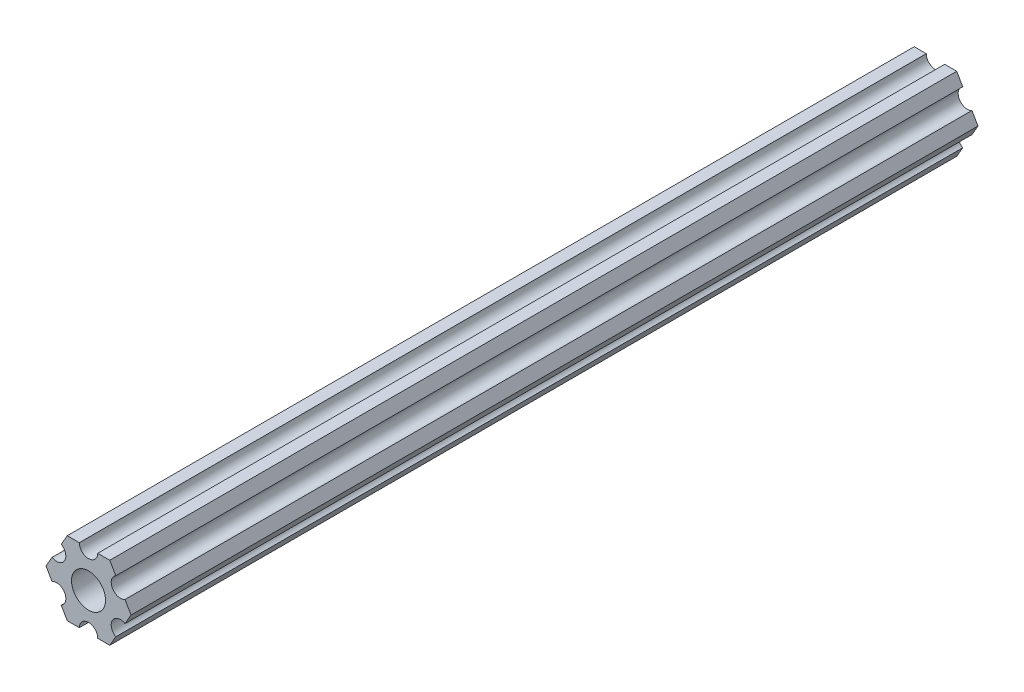
ISO-10303-21;
HEADER;
FILE_DESCRIPTION(('STEP AP214'),'2;1');
FILE_NAME('part.step','',(''),(''),'','','');
FILE_SCHEMA(('AUTOMOTIVE_DESIGN { 1 0 10303 214 1 1 1 1 }'));
ENDSEC;
DATA;
#1=APPLICATION_CONTEXT('core data for automotive mechanical design processes');
#2=APPLICATION_PROTOCOL_DEFINITION('international standard','automotive_design',2000,#1);
#3=PRODUCT_CONTEXT('',#1,'mechanical');
#4=PRODUCT('Part','Part','',(#3));
#5=PRODUCT_RELATED_PRODUCT_CATEGORY('part','',(#4));
#6=PRODUCT_DEFINITION_FORMATION('','',#4);
#7=PRODUCT_DEFINITION_CONTEXT('part definition',#1,'design');
#8=PRODUCT_DEFINITION('design','',#6,#7);
#9=PRODUCT_DEFINITION_SHAPE('','',#8);
#10=(LENGTH_UNIT() NAMED_UNIT(*) SI_UNIT(.MILLI.,.METRE.));
#11=(NAMED_UNIT(*) PLANE_ANGLE_UNIT() SI_UNIT($,.RADIAN.));
#12=(NAMED_UNIT(*) SI_UNIT($,.STERADIAN.) SOLID_ANGLE_UNIT());
#13=UNCERTAINTY_MEASURE_WITH_UNIT(LENGTH_MEASURE(1.E-05),#10,'distance_accuracy_value','');
#14=(GEOMETRIC_REPRESENTATION_CONTEXT(3) GLOBAL_UNCERTAINTY_ASSIGNED_CONTEXT((#13)) GLOBAL_UNIT_ASSIGNED_CONTEXT((#10,
#11,#12)) REPRESENTATION_CONTEXT('',''));
#15=CARTESIAN_POINT('',(0.,0.,0.));
#16=DIRECTION('',(0.,0.,1.));
#17=DIRECTION('',(1.,0.,0.));
#18=AXIS2_PLACEMENT_3D('',#15,#16,#17);
#19=CARTESIAN_POINT('',(6.29301142309098,-1.80018429024546,304.8));
#20=DIRECTION('',(-0.866025434075723,0.499999947533953,0.));
#21=DIRECTION('',(-0.499999947533953,-0.866025434075723,0.));
#22=AXIS2_PLACEMENT_3D('',#19,#20,#21);
#23=PLANE('',#22);
#24=DIRECTION('',(0.499999947533953,0.866025434075723,0.));
#25=VECTOR('',#24,1.);
#26=CARTESIAN_POINT('',(6.29301142309098,-1.80018429024546,146.05));
#27=LINE('',#26,#25);
#28=CARTESIAN_POINT('',(6.29301142309098,-1.80018429024546,146.05));
#29=VERTEX_POINT('',#28);
#30=CARTESIAN_POINT('',(7.33234841870826,4.44212519169686E-07,146.05));
#31=VERTEX_POINT('',#30);
#32=EDGE_CURVE('E173',#29,#31,#27,.T.);
#33=ORIENTED_EDGE('',*,*,#32,.F.);
#34=DIRECTION('',(0.,0.,-1.));
#35=VECTOR('',#34,1.);
#36=CARTESIAN_POINT('',(6.29301142309098,-1.80018429024546,304.8));
#37=LINE('',#36,#35);
#38=CARTESIAN_POINT('',(6.29301142309098,-1.80018429024546,0.));
#39=VERTEX_POINT('',#38);
#40=EDGE_CURVE('E61',#29,#39,#37,.T.);
#41=ORIENTED_EDGE('',*,*,#40,.T.);
#42=DIRECTION('',(0.499999947533953,0.866025434075723,0.));
#43=VECTOR('',#42,1.);
#44=CARTESIAN_POINT('',(6.29301142309098,-1.80018429024546,0.));
#45=LINE('',#44,#43);
#46=CARTESIAN_POINT('',(7.33234841870826,4.44212518961143E-07,0.));
#47=VERTEX_POINT('',#46);
#48=EDGE_CURVE('E44',#39,#47,#45,.T.);
#49=ORIENTED_EDGE('',*,*,#48,.T.);
#50=DIRECTION('',(0.,0.,1.));
#51=VECTOR('',#50,1.);
#52=CARTESIAN_POINT('',(7.33234841870826,4.44212519169686E-07,304.8));
#53=LINE('',#52,#51);
#54=EDGE_CURVE('E180',#47,#31,#53,.T.);
#55=ORIENTED_EDGE('',*,*,#54,.T.);
#56=EDGE_LOOP('',(#33,#41,#49,#55));
#57=FACE_BOUND('',#56,.T.);
#58=ADVANCED_FACE('F36',(#57),#23,.F.);
#59=CARTESIAN_POINT('',(7.33234841870826,4.44212519169686E-07,304.8));
#60=DIRECTION('',(-0.866025373493145,-0.500000052466056,0.));
#61=DIRECTION('',(0.500000052466056,-0.866025373493145,0.));
#62=AXIS2_PLACEMENT_3D('',#59,#60,#61);
#63=PLANE('',#62);
#64=DIRECTION('',(-0.500000052466056,0.866025373493145,0.));
#65=VECTOR('',#64,1.);
#66=CARTESIAN_POINT('',(7.33234841870826,4.44212519169686E-07,146.05));
#67=LINE('',#66,#65);
#68=CARTESIAN_POINT('',(6.29301120497139,1.80018505273895,146.05));
#69=VERTEX_POINT('',#68);
#70=EDGE_CURVE('E181',#31,#69,#67,.T.);
#71=ORIENTED_EDGE('',*,*,#70,.F.);
#72=ORIENTED_EDGE('',*,*,#54,.F.);
#73=DIRECTION('',(-0.500000052466056,0.866025373493145,0.));
#74=VECTOR('',#73,1.);
#75=CARTESIAN_POINT('',(7.33234841870826,4.44212519198905E-07,0.));
#76=LINE('',#75,#74);
#77=CARTESIAN_POINT('',(6.29301120497139,1.80018505273895,0.));
#78=VERTEX_POINT('',#77);
#79=EDGE_CURVE('E187',#47,#78,#76,.T.);
#80=ORIENTED_EDGE('',*,*,#79,.T.);
#81=DIRECTION('',(0.,0.,-1.));
#82=VECTOR('',#81,1.);
#83=CARTESIAN_POINT('',(6.29301120497139,1.80018505273895,304.8));
#84=LINE('',#83,#82);
#85=EDGE_CURVE('E245',#78,#69,#84,.F.);
#86=ORIENTED_EDGE('',*,*,#85,.T.);
#87=EDGE_LOOP('',(#71,#72,#80,#86));
#88=FACE_BOUND('',#87,.T.);
#89=ADVANCED_FACE('F402',(#88),#63,.F.);
#90=CARTESIAN_POINT('',(5.49926112168156,3.17500033315933,304.8));
#91=DIRECTION('',(0.,0.,-1.));
#92=DIRECTION('',(-1.,0.,0.));
#93=AXIS2_PLACEMENT_3D('',#90,#91,#92);
#94=CYLINDRICAL_SURFACE('',#93,1.5875);
#95=CARTESIAN_POINT('',(5.49926112168156,3.17500033315933,146.05));
#96=DIRECTION('',(0.,0.,1.));
#97=DIRECTION('',(1.,0.,0.));
#98=AXIS2_PLACEMENT_3D('',#95,#96,#97);
#99=CIRCLE('',#98,1.5875);
#100=CARTESIAN_POINT('',(4.70551103839172,4.54981561357972,146.05));
#101=VERTEX_POINT('',#100);
#102=EDGE_CURVE('E319',#69,#101,#99,.F.);
#103=ORIENTED_EDGE('',*,*,#102,.F.);
#104=ORIENTED_EDGE('',*,*,#85,.F.);
#105=CARTESIAN_POINT('',(5.49926112168156,3.17500033315933,0.));
#106=DIRECTION('',(0.,0.,-1.));
#107=DIRECTION('',(-1.,0.,0.));
#108=AXIS2_PLACEMENT_3D('',#105,#106,#107);
#109=CIRCLE('',#108,1.5875);
#110=CARTESIAN_POINT('',(4.70551103839172,4.54981561357972,0.));
#111=VERTEX_POINT('',#110);
#112=EDGE_CURVE('E105',#78,#111,#109,.T.);
#113=ORIENTED_EDGE('',*,*,#112,.T.);
#114=DIRECTION('',(0.,0.,1.));
#115=VECTOR('',#114,1.);
#116=CARTESIAN_POINT('',(4.70551103839172,4.54981561357972,304.8));
#117=LINE('',#116,#115);
#118=EDGE_CURVE('E241',#111,#101,#117,.T.);
#119=ORIENTED_EDGE('',*,*,#118,.T.);
#120=EDGE_LOOP('',(#103,#104,#113,#119));
#121=FACE_BOUND('',#120,.T.);
#122=ADVANCED_FACE('F400',(#121),#94,.F.);
#123=CARTESIAN_POINT('',(4.70551103839172,4.54981561357972,304.8));
#124=DIRECTION('',(-0.866025373493151,-0.500000052466046,0.));
#125=DIRECTION('',(0.500000052466046,-0.866025373493151,0.));
#126=AXIS2_PLACEMENT_3D('',#123,#124,#125);
#127=PLANE('',#126);
#128=DIRECTION('',(-0.500000052466046,0.866025373493151,0.));
#129=VECTOR('',#128,1.);
#130=CARTESIAN_POINT('',(4.70551103839172,4.54981561357972,146.05));
#131=LINE('',#130,#129);
#132=CARTESIAN_POINT('',(3.66617382465481,6.35000022210627,146.05));
#133=VERTEX_POINT('',#132);
#134=EDGE_CURVE('E321',#101,#133,#131,.T.);
#135=ORIENTED_EDGE('',*,*,#134,.F.);
#136=ORIENTED_EDGE('',*,*,#118,.F.);
#137=DIRECTION('',(-0.500000052466046,0.866025373493151,0.));
#138=VECTOR('',#137,1.);
#139=CARTESIAN_POINT('',(4.70551103839172,4.54981561357972,0.));
#140=LINE('',#139,#138);
#141=CARTESIAN_POINT('',(3.66617382465481,6.35000022210627,0.));
#142=VERTEX_POINT('',#141);
#143=EDGE_CURVE('E272',#111,#142,#140,.T.);
#144=ORIENTED_EDGE('',*,*,#143,.T.);
#145=DIRECTION('',(0.,0.,1.));
#146=VECTOR('',#145,1.);
#147=CARTESIAN_POINT('',(3.66617382465481,6.35000022210627,304.8));
#148=LINE('',#147,#146);
#149=EDGE_CURVE('E112',#142,#133,#148,.T.);
#150=ORIENTED_EDGE('',*,*,#149,.T.);
#151=EDGE_LOOP('',(#135,#136,#144,#150));
#152=FACE_BOUND('',#151,.T.);
#153=ADVANCED_FACE('F398',(#152),#127,.F.);
#154=CARTESIAN_POINT('',(3.66617382465481,6.35000022210627,304.8));
#155=DIRECTION('',(6.05825850611185E-08,-0.999999999999998,0.));
#156=DIRECTION('',(0.999999999999998,6.05825850611185E-08,0.));
#157=AXIS2_PLACEMENT_3D('',#154,#155,#156);
#158=PLANE('',#157);
#159=DIRECTION('',(-0.999999999999998,-6.05825850611185E-08,0.));
#160=VECTOR('',#159,1.);
#161=CARTESIAN_POINT('',(3.66617382465481,6.35000022210627,146.05));
#162=LINE('',#161,#160);
#163=CARTESIAN_POINT('',(1.58749961530074,6.35,146.05));
#164=VERTEX_POINT('',#163);
#165=EDGE_CURVE('E323',#133,#164,#162,.T.);
#166=ORIENTED_EDGE('',*,*,#165,.F.);
#167=ORIENTED_EDGE('',*,*,#149,.F.);
#168=DIRECTION('',(1.,0.,0.));
#169=VECTOR('',#168,1.);
#170=CARTESIAN_POINT('',(5.49926112168156,6.35000022210627,0.));
#171=LINE('',#170,#169);
#172=CARTESIAN_POINT('',(1.58749961530073,6.35000015914054,0.));
#173=VERTEX_POINT('',#172);
#174=EDGE_CURVE('E271',#142,#173,#171,.F.);
#175=ORIENTED_EDGE('',*,*,#174,.T.);
#176=DIRECTION('',(0.,0.,-1.));
#177=VECTOR('',#176,1.);
#178=CARTESIAN_POINT('',(1.58749961530074,6.35000009617482,304.8));
#179=LINE('',#178,#177);
#180=EDGE_CURVE('E237',#173,#164,#179,.F.);
#181=ORIENTED_EDGE('',*,*,#180,.T.);
#182=EDGE_LOOP('',(#166,#167,#175,#181));
#183=FACE_BOUND('',#182,.T.);
#184=ADVANCED_FACE('F396',(#183),#158,.F.);
#185=CARTESIAN_POINT('',(-3.84699260060323E-07,6.35,304.8));
#186=DIRECTION('',(0.,0.,-1.));
#187=DIRECTION('',(-1.,0.,0.));
#188=AXIS2_PLACEMENT_3D('',#185,#186,#187);
#189=CYLINDRICAL_SURFACE('',#188,1.5875);
#190=CARTESIAN_POINT('',(-3.84699260060323E-07,6.35,146.05));
#191=DIRECTION('',(0.,0.,1.));
#192=DIRECTION('',(1.,0.,0.));
#193=AXIS2_PLACEMENT_3D('',#190,#191,#192);
#194=CIRCLE('',#193,1.5875);
#195=CARTESIAN_POINT('',(-1.58750038469926,6.34999990382518,146.05));
#196=VERTEX_POINT('',#195);
#197=EDGE_CURVE('E325',#164,#196,#194,.F.);
#198=ORIENTED_EDGE('',*,*,#197,.F.);
#199=ORIENTED_EDGE('',*,*,#180,.F.);
#200=CARTESIAN_POINT('',(-3.84699260060323E-07,6.35,0.));
#201=DIRECTION('',(0.,0.,-1.));
#202=DIRECTION('',(-1.,0.,0.));
#203=AXIS2_PLACEMENT_3D('',#200,#201,#202);
#204=CIRCLE('',#203,1.5875);
#205=CARTESIAN_POINT('',(-1.58750038469926,6.34999990382518,0.));
#206=VERTEX_POINT('',#205);
#207=EDGE_CURVE('E268',#173,#206,#204,.T.);
#208=ORIENTED_EDGE('',*,*,#207,.T.);
#209=DIRECTION('',(0.,0.,1.));
#210=VECTOR('',#209,1.);
#211=CARTESIAN_POINT('',(-1.58750038469926,6.34999990382518,304.8));
#212=LINE('',#211,#210);
#213=EDGE_CURVE('E232',#206,#196,#212,.T.);
#214=ORIENTED_EDGE('',*,*,#213,.T.);
#215=EDGE_LOOP('',(#198,#199,#208,#214));
#216=FACE_BOUND('',#215,.T.);
#217=ADVANCED_FACE('F395',(#216),#189,.F.);
#218=CARTESIAN_POINT('',(-1.58750038469926,6.34999990382518,304.8));
#219=DIRECTION('',(6.05825963273174E-08,-0.999999999999998,0.));
#220=DIRECTION('',(0.999999999999998,6.05825963273174E-08,0.));
#221=AXIS2_PLACEMENT_3D('',#218,#219,#220);
#222=PLANE('',#221);
#223=DIRECTION('',(-0.999999999999998,-6.05825963273174E-08,0.));
#224=VECTOR('',#223,1.);
#225=CARTESIAN_POINT('',(-1.58750038469926,6.34999990382518,146.05));
#226=LINE('',#225,#224);
#227=CARTESIAN_POINT('',(-3.66617459405349,6.3499997778937,146.05));
#228=VERTEX_POINT('',#227);
#229=EDGE_CURVE('E327',#196,#228,#226,.T.);
#230=ORIENTED_EDGE('',*,*,#229,.F.);
#231=ORIENTED_EDGE('',*,*,#213,.F.);
#232=DIRECTION('',(1.,0.,0.));
#233=VECTOR('',#232,1.);
#234=CARTESIAN_POINT('',(5.49926112168156,6.34999990382518,0.));
#235=LINE('',#234,#233);
#236=CARTESIAN_POINT('',(-3.66617454558244,6.34999986184803,0.));
#237=VERTEX_POINT('',#236);
#238=EDGE_CURVE('E270',#206,#237,#235,.F.);
#239=ORIENTED_EDGE('',*,*,#238,.T.);
#240=DIRECTION('',(0.,0.,1.));
#241=VECTOR('',#240,1.);
#242=CARTESIAN_POINT('',(-3.66617459405349,6.3499997778937,304.8));
#243=LINE('',#242,#241);
#244=EDGE_CURVE('E229',#237,#228,#243,.T.);
#245=ORIENTED_EDGE('',*,*,#244,.T.);
#246=EDGE_LOOP('',(#230,#231,#239,#245));
#247=FACE_BOUND('',#246,.T.);
#248=ADVANCED_FACE('F392',(#247),#222,.F.);
#249=CARTESIAN_POINT('',(-3.66617459405349,6.3499997778937,304.8));
#250=DIRECTION('',(0.866025434075729,-0.499999947533942,0.));
#251=DIRECTION('',(0.499999947533942,0.866025434075729,0.));
#252=AXIS2_PLACEMENT_3D('',#249,#250,#251);
#253=PLANE('',#252);
#254=DIRECTION('',(-0.499999947533942,-0.866025434075729,0.));
#255=VECTOR('',#254,1.);
#256=CARTESIAN_POINT('',(-3.66617459405349,6.3499997778937,146.05));
#257=LINE('',#256,#255);
#258=CARTESIAN_POINT('',(-4.70551158967065,4.54981504343587,146.05));
#259=VERTEX_POINT('',#258);
#260=EDGE_CURVE('E329',#228,#259,#257,.T.);
#261=ORIENTED_EDGE('',*,*,#260,.F.);
#262=ORIENTED_EDGE('',*,*,#244,.F.);
#263=DIRECTION('',(-0.499999947533943,-0.866025434075729,0.));
#264=VECTOR('',#263,1.);
#265=CARTESIAN_POINT('',(-3.66617459405349,6.3499997778937,0.));
#266=LINE('',#265,#264);
#267=CARTESIAN_POINT('',(-4.70551158967065,4.54981504343587,0.));
#268=VERTEX_POINT('',#267);
#269=EDGE_CURVE('E267',#237,#268,#266,.T.);
#270=ORIENTED_EDGE('',*,*,#269,.T.);
#271=DIRECTION('',(0.,0.,-1.));
#272=VECTOR('',#271,1.);
#273=CARTESIAN_POINT('',(-4.70551158967065,4.54981504343587,304.8));
#274=LINE('',#273,#272);
#275=EDGE_CURVE('E226',#268,#259,#274,.F.);
#276=ORIENTED_EDGE('',*,*,#275,.T.);
#277=EDGE_LOOP('',(#261,#262,#270,#276));
#278=FACE_BOUND('',#277,.T.);
#279=ADVANCED_FACE('F387',(#278),#253,.F.);
#280=CARTESIAN_POINT('',(-5.49926150638082,3.17499966684067,304.8));
#281=DIRECTION('',(0.,0.,-1.));
#282=DIRECTION('',(-1.,0.,0.));
#283=AXIS2_PLACEMENT_3D('',#280,#281,#282);
#284=CYLINDRICAL_SURFACE('',#283,1.5875);
#285=CARTESIAN_POINT('',(-5.49926150638082,3.17499966684067,146.05));
#286=DIRECTION('',(0.,0.,1.));
#287=DIRECTION('',(1.,0.,0.));
#288=AXIS2_PLACEMENT_3D('',#285,#286,#287);
#289=CIRCLE('',#288,1.5875);
#290=CARTESIAN_POINT('',(-6.29301142309098,1.80018429024547,146.05));
#291=VERTEX_POINT('',#290);
#292=EDGE_CURVE('E331',#259,#291,#289,.F.);
#293=ORIENTED_EDGE('',*,*,#292,.F.);
#294=ORIENTED_EDGE('',*,*,#275,.F.);
#295=CARTESIAN_POINT('',(-5.49926150638082,3.17499966684067,0.));
#296=DIRECTION('',(0.,0.,-1.));
#297=DIRECTION('',(-1.,0.,0.));
#298=AXIS2_PLACEMENT_3D('',#295,#296,#297);
#299=CIRCLE('',#298,1.5875);
#300=CARTESIAN_POINT('',(-6.29301142309098,1.80018429024547,0.));
#301=VERTEX_POINT('',#300);
#302=EDGE_CURVE('E263',#268,#301,#299,.T.);
#303=ORIENTED_EDGE('',*,*,#302,.T.);
#304=DIRECTION('',(0.,0.,1.));
#305=VECTOR('',#304,1.);
#306=CARTESIAN_POINT('',(-6.29301142309098,1.80018429024547,304.8));
#307=LINE('',#306,#305);
#308=EDGE_CURVE('E221',#301,#291,#307,.T.);
#309=ORIENTED_EDGE('',*,*,#308,.T.);
#310=EDGE_LOOP('',(#293,#294,#303,#309));
#311=FACE_BOUND('',#310,.T.);
#312=ADVANCED_FACE('F384',(#311),#284,.F.);
#313=CARTESIAN_POINT('',(-6.29301142309098,1.80018429024547,304.8));
#314=DIRECTION('',(0.866025434075724,-0.499999947533951,0.));
#315=DIRECTION('',(0.499999947533951,0.866025434075724,0.));
#316=AXIS2_PLACEMENT_3D('',#313,#314,#315);
#317=PLANE('',#316);
#318=DIRECTION('',(-0.499999947533951,-0.866025434075724,0.));
#319=VECTOR('',#318,1.);
#320=CARTESIAN_POINT('',(-6.29301142309098,1.80018429024547,146.05));
#321=LINE('',#320,#319);
#322=CARTESIAN_POINT('',(-7.33234841870826,-4.44212523790841E-07,146.05));
#323=VERTEX_POINT('',#322);
#324=EDGE_CURVE('E333',#291,#323,#321,.T.);
#325=ORIENTED_EDGE('',*,*,#324,.F.);
#326=ORIENTED_EDGE('',*,*,#308,.F.);
#327=DIRECTION('',(-0.499999947533952,-0.866025434075724,0.));
#328=VECTOR('',#327,1.);
#329=CARTESIAN_POINT('',(-6.29301142309098,1.80018429024547,0.));
#330=LINE('',#329,#328);
#331=CARTESIAN_POINT('',(-7.33234841870826,-4.44212524036367E-07,0.));
#332=VERTEX_POINT('',#331);
#333=EDGE_CURVE('E266',#301,#332,#330,.T.);
#334=ORIENTED_EDGE('',*,*,#333,.T.);
#335=DIRECTION('',(0.,0.,1.));
#336=VECTOR('',#335,1.);
#337=CARTESIAN_POINT('',(-7.33234841870826,-4.44212523790841E-07,304.8));
#338=LINE('',#337,#336);
#339=EDGE_CURVE('E218',#332,#323,#338,.T.);
#340=ORIENTED_EDGE('',*,*,#339,.T.);
#341=EDGE_LOOP('',(#325,#326,#334,#340));
#342=FACE_BOUND('',#341,.T.);
#343=ADVANCED_FACE('F379',(#342),#317,.F.);
#344=CARTESIAN_POINT('',(-7.33234841870826,-4.44212523790841E-07,304.8));
#345=DIRECTION('',(0.866025373493151,0.500000052466045,0.));
#346=DIRECTION('',(-0.500000052466045,0.866025373493151,0.));
#347=AXIS2_PLACEMENT_3D('',#344,#345,#346);
#348=PLANE('',#347);
#349=DIRECTION('',(0.500000052466045,-0.866025373493151,0.));
#350=VECTOR('',#349,1.);
#351=CARTESIAN_POINT('',(-7.33234841870826,-4.44212523790841E-07,146.05));
#352=LINE('',#351,#350);
#353=CARTESIAN_POINT('',(-6.29301120497141,-1.80018505273896,146.05));
#354=VERTEX_POINT('',#353);
#355=EDGE_CURVE('E335',#323,#354,#352,.T.);
#356=ORIENTED_EDGE('',*,*,#355,.F.);
#357=ORIENTED_EDGE('',*,*,#339,.F.);
#358=DIRECTION('',(0.500000052466045,-0.866025373493151,0.));
#359=VECTOR('',#358,1.);
#360=CARTESIAN_POINT('',(-7.33234841870826,-4.44212523969395E-07,0.));
#361=LINE('',#360,#359);
#362=CARTESIAN_POINT('',(-6.29301120497141,-1.80018505273896,0.));
#363=VERTEX_POINT('',#362);
#364=EDGE_CURVE('E262',#332,#363,#361,.T.);
#365=ORIENTED_EDGE('',*,*,#364,.T.);
#366=DIRECTION('',(0.,0.,-1.));
#367=VECTOR('',#366,1.);
#368=CARTESIAN_POINT('',(-6.29301120497141,-1.80018505273896,304.8));
#369=LINE('',#368,#367);
#370=EDGE_CURVE('E215',#363,#354,#369,.F.);
#371=ORIENTED_EDGE('',*,*,#370,.T.);
#372=EDGE_LOOP('',(#356,#357,#365,#371));
#373=FACE_BOUND('',#372,.T.);
#374=ADVANCED_FACE('F376',(#373),#348,.F.);
#375=CARTESIAN_POINT('',(-5.49926112168156,-3.17500033315934,304.8));
#376=DIRECTION('',(0.,0.,-1.));
#377=DIRECTION('',(-1.,0.,0.));
#378=AXIS2_PLACEMENT_3D('',#375,#376,#377);
#379=CYLINDRICAL_SURFACE('',#378,1.5875);
#380=CARTESIAN_POINT('',(-5.49926112168156,-3.17500033315934,146.05));
#381=DIRECTION('',(0.,0.,1.));
#382=DIRECTION('',(1.,0.,0.));
#383=AXIS2_PLACEMENT_3D('',#380,#381,#382);
#384=CIRCLE('',#383,1.5875);
#385=CARTESIAN_POINT('',(-4.70551103839172,-4.54981561357972,146.05));
#386=VERTEX_POINT('',#385);
#387=EDGE_CURVE('E337',#354,#386,#384,.F.);
#388=ORIENTED_EDGE('',*,*,#387,.F.);
#389=ORIENTED_EDGE('',*,*,#370,.F.);
#390=CARTESIAN_POINT('',(-5.49926112168156,-3.17500033315934,0.));
#391=DIRECTION('',(0.,0.,-1.));
#392=DIRECTION('',(-1.,0.,0.));
#393=AXIS2_PLACEMENT_3D('',#390,#391,#392);
#394=CIRCLE('',#393,1.5875);
#395=CARTESIAN_POINT('',(-4.70551103839172,-4.54981561357972,0.));
#396=VERTEX_POINT('',#395);
#397=EDGE_CURVE('E258',#363,#396,#394,.T.);
#398=ORIENTED_EDGE('',*,*,#397,.T.);
#399=DIRECTION('',(0.,0.,1.));
#400=VECTOR('',#399,1.);
#401=CARTESIAN_POINT('',(-4.70551103839172,-4.54981561357972,304.8));
#402=LINE('',#401,#400);
#403=EDGE_CURVE('E210',#396,#386,#402,.T.);
#404=ORIENTED_EDGE('',*,*,#403,.T.);
#405=EDGE_LOOP('',(#388,#389,#398,#404));
#406=FACE_BOUND('',#405,.T.);
#407=ADVANCED_FACE('F371',(#406),#379,.F.);
#408=CARTESIAN_POINT('',(-4.70551103839172,-4.54981561357972,304.8));
#409=DIRECTION('',(0.866025373493151,0.500000052466045,0.));
#410=DIRECTION('',(-0.500000052466045,0.866025373493151,0.));
#411=AXIS2_PLACEMENT_3D('',#408,#409,#410);
#412=PLANE('',#411);
#413=DIRECTION('',(0.500000052466045,-0.866025373493151,0.));
#414=VECTOR('',#413,1.);
#415=CARTESIAN_POINT('',(-4.70551103839172,-4.54981561357972,146.05));
#416=LINE('',#415,#414);
#417=CARTESIAN_POINT('',(-3.66617382465481,-6.35000022210628,146.05));
#418=VERTEX_POINT('',#417);
#419=EDGE_CURVE('E339',#386,#418,#416,.T.);
#420=ORIENTED_EDGE('',*,*,#419,.F.);
#421=ORIENTED_EDGE('',*,*,#403,.F.);
#422=DIRECTION('',(0.500000052466045,-0.866025373493151,0.));
#423=VECTOR('',#422,1.);
#424=CARTESIAN_POINT('',(-4.70551103839172,-4.54981561357972,0.));
#425=LINE('',#424,#423);
#426=CARTESIAN_POINT('',(-3.6661738246548,-6.35000022210628,0.));
#427=VERTEX_POINT('',#426);
#428=EDGE_CURVE('E261',#396,#427,#425,.T.);
#429=ORIENTED_EDGE('',*,*,#428,.T.);
#430=DIRECTION('',(0.,0.,1.));
#431=VECTOR('',#430,1.);
#432=CARTESIAN_POINT('',(-3.66617382465481,-6.35000022210628,304.8));
#433=LINE('',#432,#431);
#434=EDGE_CURVE('E207',#427,#418,#433,.T.);
#435=ORIENTED_EDGE('',*,*,#434,.T.);
#436=EDGE_LOOP('',(#420,#421,#429,#435));
#437=FACE_BOUND('',#436,.T.);
#438=ADVANCED_FACE('F368',(#437),#412,.F.);
#439=CARTESIAN_POINT('',(-3.66617382465481,-6.35000022210628,304.8));
#440=DIRECTION('',(-6.05825854783851E-08,0.999999999999998,0.));
#441=DIRECTION('',(-0.999999999999998,-6.05825854783851E-08,0.));
#442=AXIS2_PLACEMENT_3D('',#439,#440,#441);
#443=PLANE('',#442);
#444=DIRECTION('',(0.999999999999998,6.05825854783851E-08,0.));
#445=VECTOR('',#444,1.);
#446=CARTESIAN_POINT('',(-3.66617382465481,-6.35000022210628,146.05));
#447=LINE('',#446,#445);
#448=CARTESIAN_POINT('',(-1.58749961530073,-6.35000011105314,146.05));
#449=VERTEX_POINT('',#448);
#450=EDGE_CURVE('E341',#418,#449,#447,.T.);
#451=ORIENTED_EDGE('',*,*,#450,.F.);
#452=ORIENTED_EDGE('',*,*,#434,.F.);
#453=DIRECTION('',(1.,0.,0.));
#454=VECTOR('',#453,1.);
#455=CARTESIAN_POINT('',(5.49926112168156,-6.35000022210628,0.));
#456=LINE('',#455,#454);
#457=CARTESIAN_POINT('',(-1.58749961530073,-6.35000011105314,0.));
#458=VERTEX_POINT('',#457);
#459=EDGE_CURVE('E257',#427,#458,#456,.T.);
#460=ORIENTED_EDGE('',*,*,#459,.T.);
#461=DIRECTION('',(0.,0.,-1.));
#462=VECTOR('',#461,1.);
#463=CARTESIAN_POINT('',(-1.58749961530074,-6.35,304.8));
#464=LINE('',#463,#462);
#465=EDGE_CURVE('E204',#458,#449,#464,.F.);
#466=ORIENTED_EDGE('',*,*,#465,.T.);
#467=EDGE_LOOP('',(#451,#452,#460,#466));
#468=FACE_BOUND('',#467,.T.);
#469=ADVANCED_FACE('F363',(#468),#443,.F.);
#470=CARTESIAN_POINT('',(3.8469926204343E-07,-6.35,304.8));
#471=DIRECTION('',(0.,0.,-1.));
#472=DIRECTION('',(-1.,0.,0.));
#473=AXIS2_PLACEMENT_3D('',#470,#471,#472);
#474=CYLINDRICAL_SURFACE('',#473,1.5875);
#475=CARTESIAN_POINT('',(3.8469926204343E-07,-6.35,146.05));
#476=DIRECTION('',(0.,0.,1.));
#477=DIRECTION('',(1.,0.,0.));
#478=AXIS2_PLACEMENT_3D('',#475,#476,#477);
#479=CIRCLE('',#478,1.5875);
#480=CARTESIAN_POINT('',(1.58750038469926,-6.34999990382518,146.05));
#481=VERTEX_POINT('',#480);
#482=EDGE_CURVE('E343',#449,#481,#479,.F.);
#483=ORIENTED_EDGE('',*,*,#482,.F.);
#484=ORIENTED_EDGE('',*,*,#465,.F.);
#485=CARTESIAN_POINT('',(3.8469926204343E-07,-6.35,0.));
#486=DIRECTION('',(0.,0.,-1.));
#487=DIRECTION('',(-1.,0.,0.));
#488=AXIS2_PLACEMENT_3D('',#485,#486,#487);
#489=CIRCLE('',#488,1.5875);
#490=CARTESIAN_POINT('',(1.58750038469926,-6.34999990382518,0.));
#491=VERTEX_POINT('',#490);
#492=EDGE_CURVE('E253',#458,#491,#489,.T.);
#493=ORIENTED_EDGE('',*,*,#492,.T.);
#494=DIRECTION('',(0.,0.,1.));
#495=VECTOR('',#494,1.);
#496=CARTESIAN_POINT('',(1.58750038469926,-6.34999990382518,304.8));
#497=LINE('',#496,#495);
#498=EDGE_CURVE('E199',#491,#481,#497,.T.);
#499=ORIENTED_EDGE('',*,*,#498,.T.);
#500=EDGE_LOOP('',(#483,#484,#493,#499));
#501=FACE_BOUND('',#500,.T.);
#502=ADVANCED_FACE('F360',(#501),#474,.F.);
#503=CARTESIAN_POINT('',(1.58750038469926,-6.34999990382518,304.8));
#504=DIRECTION('',(-6.05825721258438E-08,0.999999999999998,0.));
#505=DIRECTION('',(-0.999999999999998,-6.05825721258438E-08,0.));
#506=AXIS2_PLACEMENT_3D('',#503,#504,#505);
#507=PLANE('',#506);
#508=DIRECTION('',(0.999999999999998,6.05825721258438E-08,0.));
#509=VECTOR('',#508,1.);
#510=CARTESIAN_POINT('',(1.58750038469926,-6.34999990382518,146.05));
#511=LINE('',#510,#509);
#512=CARTESIAN_POINT('',(3.66617459405346,-6.34999977789375,146.05));
#513=VERTEX_POINT('',#512);
#514=EDGE_CURVE('E345',#481,#513,#511,.T.);
#515=ORIENTED_EDGE('',*,*,#514,.F.);
#516=ORIENTED_EDGE('',*,*,#498,.F.);
#517=DIRECTION('',(1.,0.,0.));
#518=VECTOR('',#517,1.);
#519=CARTESIAN_POINT('',(5.49926112168156,-6.34999990382518,0.));
#520=LINE('',#519,#518);
#521=CARTESIAN_POINT('',(3.66617454558244,-6.34999986184804,0.));
#522=VERTEX_POINT('',#521);
#523=EDGE_CURVE('E256',#491,#522,#520,.T.);
#524=ORIENTED_EDGE('',*,*,#523,.T.);
#525=DIRECTION('',(0.,0.,1.));
#526=VECTOR('',#525,1.);
#527=CARTESIAN_POINT('',(3.66617459405346,-6.34999977789375,304.8));
#528=LINE('',#527,#526);
#529=EDGE_CURVE('E192',#522,#513,#528,.T.);
#530=ORIENTED_EDGE('',*,*,#529,.T.);
#531=EDGE_LOOP('',(#515,#516,#524,#530));
#532=FACE_BOUND('',#531,.T.);
#533=ADVANCED_FACE('F353',(#532),#507,.F.);
#534=CARTESIAN_POINT('',(3.66617459405346,-6.34999977789375,304.8));
#535=DIRECTION('',(-0.86602543407573,0.499999947533941,0.));
#536=DIRECTION('',(-0.499999947533941,-0.86602543407573,0.));
#537=AXIS2_PLACEMENT_3D('',#534,#535,#536);
#538=PLANE('',#537);
#539=DIRECTION('',(0.499999947533941,0.86602543407573,0.));
#540=VECTOR('',#539,1.);
#541=CARTESIAN_POINT('',(3.66617459405346,-6.34999977789375,146.05));
#542=LINE('',#541,#540);
#543=CARTESIAN_POINT('',(4.70551158967065,-4.54981504343587,146.05));
#544=VERTEX_POINT('',#543);
#545=EDGE_CURVE('E52',#513,#544,#542,.T.);
#546=ORIENTED_EDGE('',*,*,#545,.F.);
#547=ORIENTED_EDGE('',*,*,#529,.F.);
#548=DIRECTION('',(0.49999994753394,0.86602543407573,0.));
#549=VECTOR('',#548,1.);
#550=CARTESIAN_POINT('',(3.66617459405346,-6.34999977789376,0.));
#551=LINE('',#550,#549);
#552=CARTESIAN_POINT('',(4.70551158967065,-4.54981504343587,0.));
#553=VERTEX_POINT('',#552);
#554=EDGE_CURVE('E252',#522,#553,#551,.T.);
#555=ORIENTED_EDGE('',*,*,#554,.T.);
#556=DIRECTION('',(0.,0.,1.));
#557=VECTOR('',#556,1.);
#558=CARTESIAN_POINT('',(4.70551158967065,-4.54981504343587,304.8));
#559=LINE('',#558,#557);
#560=EDGE_CURVE('E188',#544,#553,#559,.F.);
#561=ORIENTED_EDGE('',*,*,#560,.F.);
#562=EDGE_LOOP('',(#546,#547,#555,#561));
#563=FACE_BOUND('',#562,.T.);
#564=ADVANCED_FACE('F351',(#563),#538,.F.);
#565=CARTESIAN_POINT('',(5.49926150638082,-3.17499966684067,304.8));
#566=DIRECTION('',(0.,0.,-1.));
#567=DIRECTION('',(-1.,0.,0.));
#568=AXIS2_PLACEMENT_3D('',#565,#566,#567);
#569=CYLINDRICAL_SURFACE('',#568,1.58750000000001);
#570=CARTESIAN_POINT('',(5.49926150638082,-3.17499966684067,146.05));
#571=DIRECTION('',(0.,0.,1.));
#572=DIRECTION('',(1.,0.,0.));
#573=AXIS2_PLACEMENT_3D('',#570,#571,#572);
#574=CIRCLE('',#573,1.58750000000001);
#575=EDGE_CURVE('E171',#544,#29,#574,.F.);
#576=ORIENTED_EDGE('',*,*,#575,.F.);
#577=ORIENTED_EDGE('',*,*,#560,.T.);
#578=CARTESIAN_POINT('',(5.49926150638082,-3.17499966684067,0.));
#579=DIRECTION('',(0.,0.,-1.));
#580=DIRECTION('',(-1.,0.,0.));
#581=AXIS2_PLACEMENT_3D('',#578,#579,#580);
#582=CIRCLE('',#581,1.58750000000001);
#583=EDGE_CURVE('E186',#553,#39,#582,.T.);
#584=ORIENTED_EDGE('',*,*,#583,.T.);
#585=ORIENTED_EDGE('',*,*,#40,.F.);
#586=EDGE_LOOP('',(#576,#577,#584,#585));
#587=FACE_BOUND('',#586,.T.);
#588=ADVANCED_FACE('F184',(#587),#569,.F.);
#589=CARTESIAN_POINT('',(0.,0.,304.8));
#590=DIRECTION('',(0.,0.,-1.));
#591=DIRECTION('',(-1.,0.,0.));
#592=AXIS2_PLACEMENT_3D('',#589,#590,#591);
#593=CYLINDRICAL_SURFACE('',#592,2.9337);
#594=CARTESIAN_POINT('',(0.,0.,0.));
#595=DIRECTION('',(0.,0.,-1.));
#596=DIRECTION('',(-1.,0.,0.));
#597=AXIS2_PLACEMENT_3D('',#594,#595,#596);
#598=CIRCLE('',#597,2.9337);
#599=CARTESIAN_POINT('',(-2.9337,0.,0.));
#600=VERTEX_POINT('',#599);
#601=EDGE_CURVE('E12',#600,#600,#598,.F.);
#602=ORIENTED_EDGE('',*,*,#601,.F.);
#603=EDGE_LOOP('',(#602));
#604=FACE_BOUND('',#603,.T.);
#605=CARTESIAN_POINT('',(0.,0.,146.05));
#606=DIRECTION('',(0.,0.,1.));
#607=DIRECTION('',(1.,0.,0.));
#608=AXIS2_PLACEMENT_3D('',#605,#606,#607);
#609=CIRCLE('',#608,2.9337);
#610=CARTESIAN_POINT('',(2.9337,0.,146.05));
#611=VERTEX_POINT('',#610);
#612=EDGE_CURVE('E39',#611,#611,#609,.F.);
#613=ORIENTED_EDGE('',*,*,#612,.F.);
#614=EDGE_LOOP('',(#613));
#615=FACE_BOUND('',#614,.T.);
#616=ADVANCED_FACE('F441',(#604,#615),#593,.F.);
#617=CARTESIAN_POINT('',(5.49926112168156,3.17500033315933,0.));
#618=DIRECTION('',(0.,0.,1.));
#619=DIRECTION('',(1.,0.,0.));
#620=AXIS2_PLACEMENT_3D('',#617,#618,#619);
#621=PLANE('',#620);
#622=ORIENTED_EDGE('',*,*,#601,.T.);
#623=EDGE_LOOP('',(#622));
#624=FACE_BOUND('',#623,.T.);
#625=ORIENTED_EDGE('',*,*,#583,.F.);
#626=ORIENTED_EDGE('',*,*,#554,.F.);
#627=ORIENTED_EDGE('',*,*,#523,.F.);
#628=ORIENTED_EDGE('',*,*,#492,.F.);
#629=ORIENTED_EDGE('',*,*,#459,.F.);
#630=ORIENTED_EDGE('',*,*,#428,.F.);
#631=ORIENTED_EDGE('',*,*,#397,.F.);
#632=ORIENTED_EDGE('',*,*,#364,.F.);
#633=ORIENTED_EDGE('',*,*,#333,.F.);
#634=ORIENTED_EDGE('',*,*,#302,.F.);
#635=ORIENTED_EDGE('',*,*,#269,.F.);
#636=ORIENTED_EDGE('',*,*,#238,.F.);
#637=ORIENTED_EDGE('',*,*,#207,.F.);
#638=ORIENTED_EDGE('',*,*,#174,.F.);
#639=ORIENTED_EDGE('',*,*,#143,.F.);
#640=ORIENTED_EDGE('',*,*,#112,.F.);
#641=ORIENTED_EDGE('',*,*,#79,.F.);
#642=ORIENTED_EDGE('',*,*,#48,.F.);
#643=EDGE_LOOP('',(#625,#626,#627,#628,#629,#630,#631,#632,#633,#634,#635,#636,#637,#638,#639,
#640,#641,#642));
#644=FACE_BOUND('',#643,.T.);
#645=ADVANCED_FACE('F357',(#624,#644),#621,.F.);
#646=CARTESIAN_POINT('',(5.49926112168156,3.17500033315933,146.05));
#647=DIRECTION('',(0.,0.,1.));
#648=DIRECTION('',(1.,0.,0.));
#649=AXIS2_PLACEMENT_3D('',#646,#647,#648);
#650=PLANE('',#649);
#651=ORIENTED_EDGE('',*,*,#612,.T.);
#652=EDGE_LOOP('',(#651));
#653=FACE_BOUND('',#652,.T.);
#654=ORIENTED_EDGE('',*,*,#32,.T.);
#655=ORIENTED_EDGE('',*,*,#70,.T.);
#656=ORIENTED_EDGE('',*,*,#102,.T.);
#657=ORIENTED_EDGE('',*,*,#134,.T.);
#658=ORIENTED_EDGE('',*,*,#165,.T.);
#659=ORIENTED_EDGE('',*,*,#197,.T.);
#660=ORIENTED_EDGE('',*,*,#229,.T.);
#661=ORIENTED_EDGE('',*,*,#260,.T.);
#662=ORIENTED_EDGE('',*,*,#292,.T.);
#663=ORIENTED_EDGE('',*,*,#324,.T.);
#664=ORIENTED_EDGE('',*,*,#355,.T.);
#665=ORIENTED_EDGE('',*,*,#387,.T.);
#666=ORIENTED_EDGE('',*,*,#419,.T.);
#667=ORIENTED_EDGE('',*,*,#450,.T.);
#668=ORIENTED_EDGE('',*,*,#482,.T.);
#669=ORIENTED_EDGE('',*,*,#514,.T.);
#670=ORIENTED_EDGE('',*,*,#545,.T.);
#671=ORIENTED_EDGE('',*,*,#575,.T.);
#672=EDGE_LOOP('',(#654,#655,#656,#657,#658,#659,#660,#661,#662,#663,#664,#665,#666,#667,#668,
#669,#670,#671));
#673=FACE_BOUND('',#672,.T.);
#674=ADVANCED_FACE('F172',(#653,#673),#650,.T.);
#675=CLOSED_SHELL('',(#58,#89,#122,#153,#184,#217,#248,#279,#312,#343,#374,#407,#438,#469,#502,
#533,#564,#588,#616,#645,#674));
#676=MANIFOLD_SOLID_BREP('B2',#675);
#677=ADVANCED_BREP_SHAPE_REPRESENTATION('',(#18,#676),#14);
#678=SHAPE_DEFINITION_REPRESENTATION(#9,#677);
ENDSEC;
END-ISO-10303-21;
